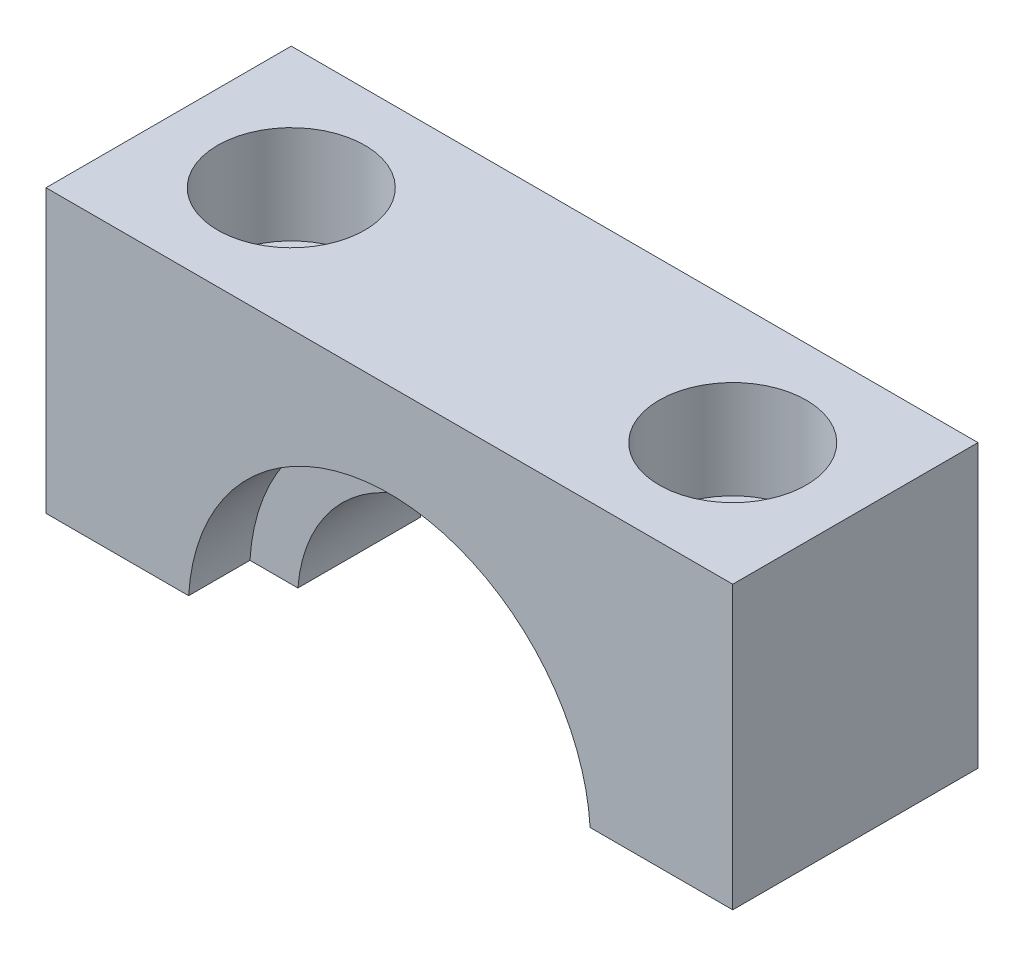
ISO-10303-21;
HEADER;
FILE_DESCRIPTION(('STEP AP214'),'2;1');
FILE_NAME('part.step','',(''),(''),'','','');
FILE_SCHEMA(('AUTOMOTIVE_DESIGN { 1 0 10303 214 1 1 1 1 }'));
ENDSEC;
DATA;
#1=APPLICATION_CONTEXT('core data for automotive mechanical design processes');
#2=APPLICATION_PROTOCOL_DEFINITION('international standard','automotive_design',2000,#1);
#3=PRODUCT_CONTEXT('',#1,'mechanical');
#4=PRODUCT('Part','Part','',(#3));
#5=PRODUCT_RELATED_PRODUCT_CATEGORY('part','',(#4));
#6=PRODUCT_DEFINITION_FORMATION('','',#4);
#7=PRODUCT_DEFINITION_CONTEXT('part definition',#1,'design');
#8=PRODUCT_DEFINITION('design','',#6,#7);
#9=PRODUCT_DEFINITION_SHAPE('','',#8);
#10=(LENGTH_UNIT() NAMED_UNIT(*) SI_UNIT(.MILLI.,.METRE.));
#11=(NAMED_UNIT(*) PLANE_ANGLE_UNIT() SI_UNIT($,.RADIAN.));
#12=(NAMED_UNIT(*) SI_UNIT($,.STERADIAN.) SOLID_ANGLE_UNIT());
#13=UNCERTAINTY_MEASURE_WITH_UNIT(LENGTH_MEASURE(1.E-05),#10,'distance_accuracy_value','');
#14=(GEOMETRIC_REPRESENTATION_CONTEXT(3) GLOBAL_UNCERTAINTY_ASSIGNED_CONTEXT((#13)) GLOBAL_UNIT_ASSIGNED_CONTEXT((#10,
#11,#12)) REPRESENTATION_CONTEXT('',''));
#15=CARTESIAN_POINT('',(0.,0.,0.));
#16=DIRECTION('',(0.,0.,1.));
#17=DIRECTION('',(1.,0.,0.));
#18=AXIS2_PLACEMENT_3D('',#15,#16,#17);
#19=CARTESIAN_POINT('',(9.,15.5,0.));
#20=DIRECTION('',(0.,-1.,0.));
#21=DIRECTION('',(1.,0.,0.));
#22=AXIS2_PLACEMENT_3D('',#19,#20,#21);
#23=CYLINDRICAL_SURFACE('',#22,1.65);
#24=CARTESIAN_POINT('',(9.,0.500000000000005,0.));
#25=DIRECTION('',(0.,-1.,0.));
#26=DIRECTION('',(-1.,0.,0.));
#27=AXIS2_PLACEMENT_3D('',#24,#25,#26);
#28=CIRCLE('',#27,1.65);
#29=CARTESIAN_POINT('',(7.35,0.500000000000004,0.));
#30=VERTEX_POINT('',#29);
#31=EDGE_CURVE('E191',#30,#30,#28,.T.);
#32=ORIENTED_EDGE('',*,*,#31,.T.);
#33=EDGE_LOOP('',(#32));
#34=FACE_BOUND('',#33,.T.);
#35=CARTESIAN_POINT('',(9.,8.,0.));
#36=DIRECTION('',(0.,1.,0.));
#37=DIRECTION('',(-1.,0.,0.));
#38=AXIS2_PLACEMENT_3D('',#35,#36,#37);
#39=CIRCLE('',#38,1.65);
#40=CARTESIAN_POINT('',(7.35,8.,0.));
#41=VERTEX_POINT('',#40);
#42=EDGE_CURVE('E36',#41,#41,#39,.F.);
#43=ORIENTED_EDGE('',*,*,#42,.F.);
#44=EDGE_LOOP('',(#43));
#45=FACE_BOUND('',#44,.T.);
#46=ADVANCED_FACE('F32',(#34,#45),#23,.F.);
#47=CARTESIAN_POINT('',(-9.,15.5,0.));
#48=DIRECTION('',(0.,-1.,0.));
#49=DIRECTION('',(1.,0.,0.));
#50=AXIS2_PLACEMENT_3D('',#47,#48,#49);
#51=CYLINDRICAL_SURFACE('',#50,1.65);
#52=CARTESIAN_POINT('',(-9.,0.500000000000001,0.));
#53=DIRECTION('',(0.,-1.,0.));
#54=DIRECTION('',(1.,0.,0.));
#55=AXIS2_PLACEMENT_3D('',#52,#53,#54);
#56=CIRCLE('',#55,1.65);
#57=CARTESIAN_POINT('',(-7.35,0.500000000000001,0.));
#58=VERTEX_POINT('',#57);
#59=EDGE_CURVE('E139',#58,#58,#56,.T.);
#60=ORIENTED_EDGE('',*,*,#59,.T.);
#61=EDGE_LOOP('',(#60));
#62=FACE_BOUND('',#61,.T.);
#63=CARTESIAN_POINT('',(-9.,8.,0.));
#64=DIRECTION('',(0.,1.,0.));
#65=DIRECTION('',(-1.,0.,0.));
#66=AXIS2_PLACEMENT_3D('',#63,#64,#65);
#67=CIRCLE('',#66,1.65);
#68=CARTESIAN_POINT('',(-10.65,8.,0.));
#69=VERTEX_POINT('',#68);
#70=EDGE_CURVE('E189',#69,#69,#67,.F.);
#71=ORIENTED_EDGE('',*,*,#70,.F.);
#72=EDGE_LOOP('',(#71));
#73=FACE_BOUND('',#72,.T.);
#74=ADVANCED_FACE('F217',(#62,#73),#51,.F.);
#75=CARTESIAN_POINT('',(0.,0.,2.5));
#76=DIRECTION('',(0.,0.,1.));
#77=DIRECTION('',(1.,0.,0.));
#78=AXIS2_PLACEMENT_3D('',#75,#76,#77);
#79=PLANE('',#78);
#80=DIRECTION('',(1.,0.,0.));
#81=VECTOR('',#80,1.);
#82=CARTESIAN_POINT('',(14.,0.5,2.5));
#83=LINE('',#82,#81);
#84=CARTESIAN_POINT('',(6.22996789718856,0.500000000000001,2.5));
#85=VERTEX_POINT('',#84);
#86=CARTESIAN_POINT('',(8.18474190185616,0.500000000000001,2.5));
#87=VERTEX_POINT('',#86);
#88=EDGE_CURVE('E54',#85,#87,#83,.T.);
#89=ORIENTED_EDGE('',*,*,#88,.T.);
#90=CARTESIAN_POINT('',(0.,0.,2.5));
#91=DIRECTION('',(0.,0.,1.));
#92=DIRECTION('',(1.,0.,0.));
#93=AXIS2_PLACEMENT_3D('',#90,#91,#92);
#94=CIRCLE('',#93,8.2);
#95=CARTESIAN_POINT('',(-8.18474190185616,0.500000000000001,2.5));
#96=VERTEX_POINT('',#95);
#97=EDGE_CURVE('E49',#87,#96,#94,.T.);
#98=ORIENTED_EDGE('',*,*,#97,.T.);
#99=DIRECTION('',(1.,0.,0.));
#100=VECTOR('',#99,1.);
#101=CARTESIAN_POINT('',(-6.22996789718856,0.500000000000002,2.5));
#102=LINE('',#101,#100);
#103=CARTESIAN_POINT('',(-6.22996789718856,0.500000000000002,2.5));
#104=VERTEX_POINT('',#103);
#105=EDGE_CURVE('E173',#96,#104,#102,.T.);
#106=ORIENTED_EDGE('',*,*,#105,.T.);
#107=CARTESIAN_POINT('',(0.,0.,2.5));
#108=DIRECTION('',(0.,0.,-1.));
#109=DIRECTION('',(1.,0.,0.));
#110=AXIS2_PLACEMENT_3D('',#107,#108,#109);
#111=CIRCLE('',#110,6.25);
#112=EDGE_CURVE('E169',#104,#85,#111,.T.);
#113=ORIENTED_EDGE('',*,*,#112,.T.);
#114=EDGE_LOOP('',(#89,#98,#106,#113));
#115=FACE_BOUND('',#114,.T.);
#116=ADVANCED_FACE('F223',(#115),#79,.T.);
#117=CARTESIAN_POINT('',(0.,0.,-2.5));
#118=DIRECTION('',(0.,0.,1.));
#119=DIRECTION('',(1.,0.,0.));
#120=AXIS2_PLACEMENT_3D('',#117,#118,#119);
#121=PLANE('',#120);
#122=CARTESIAN_POINT('',(0.,0.,-2.5));
#123=DIRECTION('',(0.,0.,1.));
#124=DIRECTION('',(1.,0.,0.));
#125=AXIS2_PLACEMENT_3D('',#122,#123,#124);
#126=CIRCLE('',#125,8.2);
#127=CARTESIAN_POINT('',(8.18474190185616,0.5,-2.5));
#128=VERTEX_POINT('',#127);
#129=CARTESIAN_POINT('',(-8.18474190185616,0.5,-2.5));
#130=VERTEX_POINT('',#129);
#131=EDGE_CURVE('E11',#128,#130,#126,.T.);
#132=ORIENTED_EDGE('',*,*,#131,.F.);
#133=DIRECTION('',(1.,0.,0.));
#134=VECTOR('',#133,1.);
#135=CARTESIAN_POINT('',(14.,0.5,-2.5));
#136=LINE('',#135,#134);
#137=CARTESIAN_POINT('',(6.22996789718856,0.500000000000001,-2.5));
#138=VERTEX_POINT('',#137);
#139=EDGE_CURVE('E178',#138,#128,#136,.T.);
#140=ORIENTED_EDGE('',*,*,#139,.F.);
#141=CARTESIAN_POINT('',(0.,0.,-2.5));
#142=DIRECTION('',(0.,0.,-1.));
#143=DIRECTION('',(1.,0.,0.));
#144=AXIS2_PLACEMENT_3D('',#141,#142,#143);
#145=CIRCLE('',#144,6.25);
#146=CARTESIAN_POINT('',(-6.22996789718856,0.500000000000002,-2.5));
#147=VERTEX_POINT('',#146);
#148=EDGE_CURVE('E168',#147,#138,#145,.T.);
#149=ORIENTED_EDGE('',*,*,#148,.F.);
#150=DIRECTION('',(1.,0.,0.));
#151=VECTOR('',#150,1.);
#152=CARTESIAN_POINT('',(-6.22996789718856,0.500000000000002,-2.5));
#153=LINE('',#152,#151);
#154=EDGE_CURVE('E171',#130,#147,#153,.T.);
#155=ORIENTED_EDGE('',*,*,#154,.F.);
#156=EDGE_LOOP('',(#132,#140,#149,#155));
#157=FACE_BOUND('',#156,.T.);
#158=ADVANCED_FACE('F245',(#157),#121,.F.);
#159=CARTESIAN_POINT('',(0.,0.,2.5));
#160=DIRECTION('',(0.,0.,-1.));
#161=DIRECTION('',(-1.,0.,0.));
#162=AXIS2_PLACEMENT_3D('',#159,#160,#161);
#163=CYLINDRICAL_SURFACE('',#162,6.25);
#164=ORIENTED_EDGE('',*,*,#148,.T.);
#165=DIRECTION('',(0.,0.,-1.));
#166=VECTOR('',#165,1.);
#167=CARTESIAN_POINT('',(6.22996789718856,0.500000000000001,2.5));
#168=LINE('',#167,#166);
#169=EDGE_CURVE('E41',#85,#138,#168,.T.);
#170=ORIENTED_EDGE('',*,*,#169,.F.);
#171=ORIENTED_EDGE('',*,*,#112,.F.);
#172=DIRECTION('',(0.,0.,-1.));
#173=VECTOR('',#172,1.);
#174=CARTESIAN_POINT('',(-6.22996789718856,0.500000000000002,2.5));
#175=LINE('',#174,#173);
#176=EDGE_CURVE('E175',#104,#147,#175,.T.);
#177=ORIENTED_EDGE('',*,*,#176,.T.);
#178=EDGE_LOOP('',(#164,#170,#171,#177));
#179=FACE_BOUND('',#178,.T.);
#180=ADVANCED_FACE('F34',(#179),#163,.F.);
#181=CARTESIAN_POINT('',(14.,0.5,2.5));
#182=DIRECTION('',(0.,1.,0.));
#183=DIRECTION('',(-1.,0.,0.));
#184=AXIS2_PLACEMENT_3D('',#181,#182,#183);
#185=PLANE('',#184);
#186=ORIENTED_EDGE('',*,*,#31,.F.);
#187=EDGE_LOOP('',(#186));
#188=FACE_BOUND('',#187,.T.);
#189=DIRECTION('',(0.,0.,-1.));
#190=VECTOR('',#189,1.);
#191=CARTESIAN_POINT('',(14.,0.5,2.5));
#192=LINE('',#191,#190);
#193=CARTESIAN_POINT('',(14.,0.5,5.));
#194=VERTEX_POINT('',#193);
#195=CARTESIAN_POINT('',(14.,0.5,-5.));
#196=VERTEX_POINT('',#195);
#197=EDGE_CURVE('E186',#194,#196,#192,.T.);
#198=ORIENTED_EDGE('',*,*,#197,.F.);
#199=DIRECTION('',(1.,0.,0.));
#200=VECTOR('',#199,1.);
#201=CARTESIAN_POINT('',(8.18474190185616,0.5,5.));
#202=LINE('',#201,#200);
#203=CARTESIAN_POINT('',(8.18474190185616,0.5,5.));
#204=VERTEX_POINT('',#203);
#205=EDGE_CURVE('E145',#204,#194,#202,.T.);
#206=ORIENTED_EDGE('',*,*,#205,.F.);
#207=DIRECTION('',(0.,0.,-1.));
#208=VECTOR('',#207,1.);
#209=CARTESIAN_POINT('',(8.18474190185616,0.5,5.));
#210=LINE('',#209,#208);
#211=EDGE_CURVE('E160',#204,#87,#210,.T.);
#212=ORIENTED_EDGE('',*,*,#211,.T.);
#213=ORIENTED_EDGE('',*,*,#88,.F.);
#214=ORIENTED_EDGE('',*,*,#169,.T.);
#215=ORIENTED_EDGE('',*,*,#139,.T.);
#216=CARTESIAN_POINT('',(8.18474190185616,0.5,-5.));
#217=VERTEX_POINT('',#216);
#218=EDGE_CURVE('E148',#128,#217,#210,.T.);
#219=ORIENTED_EDGE('',*,*,#218,.T.);
#220=DIRECTION('',(1.,0.,0.));
#221=VECTOR('',#220,1.);
#222=CARTESIAN_POINT('',(8.18474190185616,0.5,-5.));
#223=LINE('',#222,#221);
#224=EDGE_CURVE('E136',#217,#196,#223,.T.);
#225=ORIENTED_EDGE('',*,*,#224,.T.);
#226=EDGE_LOOP('',(#198,#206,#212,#213,#214,#215,#219,#225));
#227=FACE_BOUND('',#226,.T.);
#228=ADVANCED_FACE('F259',(#188,#227),#185,.F.);
#229=CARTESIAN_POINT('',(14.,12.,2.5));
#230=DIRECTION('',(-1.,0.,0.));
#231=DIRECTION('',(0.,-1.,0.));
#232=AXIS2_PLACEMENT_3D('',#229,#230,#231);
#233=PLANE('',#232);
#234=ORIENTED_EDGE('',*,*,#197,.T.);
#235=DIRECTION('',(0.,1.,0.));
#236=VECTOR('',#235,1.);
#237=CARTESIAN_POINT('',(14.,0.5,-5.));
#238=LINE('',#237,#236);
#239=CARTESIAN_POINT('',(14.,12.,-5.));
#240=VERTEX_POINT('',#239);
#241=EDGE_CURVE('E133',#196,#240,#238,.T.);
#242=ORIENTED_EDGE('',*,*,#241,.T.);
#243=DIRECTION('',(0.,0.,-1.));
#244=VECTOR('',#243,1.);
#245=CARTESIAN_POINT('',(14.,12.,2.5));
#246=LINE('',#245,#244);
#247=CARTESIAN_POINT('',(14.,12.,5.));
#248=VERTEX_POINT('',#247);
#249=EDGE_CURVE('E118',#248,#240,#246,.T.);
#250=ORIENTED_EDGE('',*,*,#249,.F.);
#251=DIRECTION('',(0.,1.,0.));
#252=VECTOR('',#251,1.);
#253=CARTESIAN_POINT('',(14.,0.5,5.));
#254=LINE('',#253,#252);
#255=EDGE_CURVE('E132',#194,#248,#254,.T.);
#256=ORIENTED_EDGE('',*,*,#255,.F.);
#257=EDGE_LOOP('',(#234,#242,#250,#256));
#258=FACE_BOUND('',#257,.T.);
#259=ADVANCED_FACE('F256',(#258),#233,.F.);
#260=CARTESIAN_POINT('',(-14.,12.,2.5));
#261=DIRECTION('',(0.,-1.,0.));
#262=DIRECTION('',(1.,0.,0.));
#263=AXIS2_PLACEMENT_3D('',#260,#261,#262);
#264=PLANE('',#263);
#265=CARTESIAN_POINT('',(9.,12.,0.));
#266=DIRECTION('',(0.,1.,0.));
#267=DIRECTION('',(-1.,0.,0.));
#268=AXIS2_PLACEMENT_3D('',#265,#266,#267);
#269=CIRCLE('',#268,3.);
#270=CARTESIAN_POINT('',(5.99999999999999,12.,0.));
#271=VERTEX_POINT('',#270);
#272=EDGE_CURVE('E204',#271,#271,#269,.T.);
#273=ORIENTED_EDGE('',*,*,#272,.F.);
#274=EDGE_LOOP('',(#273));
#275=FACE_BOUND('',#274,.T.);
#276=CARTESIAN_POINT('',(-9.,12.,0.));
#277=DIRECTION('',(0.,1.,0.));
#278=DIRECTION('',(-1.,0.,0.));
#279=AXIS2_PLACEMENT_3D('',#276,#277,#278);
#280=CIRCLE('',#279,3.);
#281=CARTESIAN_POINT('',(-12.,12.,0.));
#282=VERTEX_POINT('',#281);
#283=EDGE_CURVE('E197',#282,#282,#280,.T.);
#284=ORIENTED_EDGE('',*,*,#283,.F.);
#285=EDGE_LOOP('',(#284));
#286=FACE_BOUND('',#285,.T.);
#287=ORIENTED_EDGE('',*,*,#249,.T.);
#288=DIRECTION('',(-1.,0.,0.));
#289=VECTOR('',#288,1.);
#290=CARTESIAN_POINT('',(14.,12.,-5.));
#291=LINE('',#290,#289);
#292=CARTESIAN_POINT('',(-14.,12.,-5.));
#293=VERTEX_POINT('',#292);
#294=EDGE_CURVE('E114',#240,#293,#291,.T.);
#295=ORIENTED_EDGE('',*,*,#294,.T.);
#296=DIRECTION('',(0.,0.,-1.));
#297=VECTOR('',#296,1.);
#298=CARTESIAN_POINT('',(-14.,12.,2.5));
#299=LINE('',#298,#297);
#300=CARTESIAN_POINT('',(-14.,12.,5.));
#301=VERTEX_POINT('',#300);
#302=EDGE_CURVE('E108',#301,#293,#299,.T.);
#303=ORIENTED_EDGE('',*,*,#302,.F.);
#304=DIRECTION('',(-1.,0.,0.));
#305=VECTOR('',#304,1.);
#306=CARTESIAN_POINT('',(14.,12.,5.));
#307=LINE('',#306,#305);
#308=EDGE_CURVE('E112',#248,#301,#307,.T.);
#309=ORIENTED_EDGE('',*,*,#308,.F.);
#310=EDGE_LOOP('',(#287,#295,#303,#309));
#311=FACE_BOUND('',#310,.T.);
#312=ADVANCED_FACE('F110',(#275,#286,#311),#264,.F.);
#313=CARTESIAN_POINT('',(-14.,0.5,2.5));
#314=DIRECTION('',(1.,0.,0.));
#315=DIRECTION('',(0.,0.,-1.));
#316=AXIS2_PLACEMENT_3D('',#313,#314,#315);
#317=PLANE('',#316);
#318=ORIENTED_EDGE('',*,*,#302,.T.);
#319=DIRECTION('',(0.,-1.,0.));
#320=VECTOR('',#319,1.);
#321=CARTESIAN_POINT('',(-14.,12.,-5.));
#322=LINE('',#321,#320);
#323=CARTESIAN_POINT('',(-14.,0.5,-5.));
#324=VERTEX_POINT('',#323);
#325=EDGE_CURVE('E150',#293,#324,#322,.T.);
#326=ORIENTED_EDGE('',*,*,#325,.T.);
#327=DIRECTION('',(0.,0.,-1.));
#328=VECTOR('',#327,1.);
#329=CARTESIAN_POINT('',(-14.,0.5,2.5));
#330=LINE('',#329,#328);
#331=CARTESIAN_POINT('',(-14.,0.5,5.));
#332=VERTEX_POINT('',#331);
#333=EDGE_CURVE('E119',#332,#324,#330,.T.);
#334=ORIENTED_EDGE('',*,*,#333,.F.);
#335=DIRECTION('',(0.,-1.,0.));
#336=VECTOR('',#335,1.);
#337=CARTESIAN_POINT('',(-14.,12.,5.));
#338=LINE('',#337,#336);
#339=EDGE_CURVE('E122',#301,#332,#338,.T.);
#340=ORIENTED_EDGE('',*,*,#339,.F.);
#341=EDGE_LOOP('',(#318,#326,#334,#340));
#342=FACE_BOUND('',#341,.T.);
#343=ADVANCED_FACE('F123',(#342),#317,.F.);
#344=CARTESIAN_POINT('',(-6.22996789718856,0.500000000000002,2.5));
#345=DIRECTION('',(0.,1.,0.));
#346=DIRECTION('',(-1.,0.,0.));
#347=AXIS2_PLACEMENT_3D('',#344,#345,#346);
#348=PLANE('',#347);
#349=ORIENTED_EDGE('',*,*,#59,.F.);
#350=EDGE_LOOP('',(#349));
#351=FACE_BOUND('',#350,.T.);
#352=ORIENTED_EDGE('',*,*,#333,.T.);
#353=DIRECTION('',(1.,0.,0.));
#354=VECTOR('',#353,1.);
#355=CARTESIAN_POINT('',(-14.,0.5,-5.));
#356=LINE('',#355,#354);
#357=CARTESIAN_POINT('',(-8.18474190185616,0.5,-5.));
#358=VERTEX_POINT('',#357);
#359=EDGE_CURVE('E152',#324,#358,#356,.T.);
#360=ORIENTED_EDGE('',*,*,#359,.T.);
#361=DIRECTION('',(0.,0.,-1.));
#362=VECTOR('',#361,1.);
#363=CARTESIAN_POINT('',(-8.18474190185616,0.5,5.));
#364=LINE('',#363,#362);
#365=EDGE_CURVE('E163',#130,#358,#364,.T.);
#366=ORIENTED_EDGE('',*,*,#365,.F.);
#367=ORIENTED_EDGE('',*,*,#154,.T.);
#368=ORIENTED_EDGE('',*,*,#176,.F.);
#369=ORIENTED_EDGE('',*,*,#105,.F.);
#370=CARTESIAN_POINT('',(-8.18474190185616,0.5,5.));
#371=VERTEX_POINT('',#370);
#372=EDGE_CURVE('E164',#371,#96,#364,.T.);
#373=ORIENTED_EDGE('',*,*,#372,.F.);
#374=DIRECTION('',(1.,0.,0.));
#375=VECTOR('',#374,1.);
#376=CARTESIAN_POINT('',(-14.,0.5,5.));
#377=LINE('',#376,#375);
#378=EDGE_CURVE('E126',#332,#371,#377,.T.);
#379=ORIENTED_EDGE('',*,*,#378,.F.);
#380=EDGE_LOOP('',(#352,#360,#366,#367,#368,#369,#373,#379));
#381=FACE_BOUND('',#380,.T.);
#382=ADVANCED_FACE('F238',(#351,#381),#348,.F.);
#383=CARTESIAN_POINT('',(0.,0.,-5.));
#384=DIRECTION('',(0.,0.,1.));
#385=DIRECTION('',(1.,0.,0.));
#386=AXIS2_PLACEMENT_3D('',#383,#384,#385);
#387=PLANE('',#386);
#388=ORIENTED_EDGE('',*,*,#294,.F.);
#389=ORIENTED_EDGE('',*,*,#241,.F.);
#390=ORIENTED_EDGE('',*,*,#224,.F.);
#391=CARTESIAN_POINT('',(0.,0.,-5.));
#392=DIRECTION('',(0.,0.,-1.));
#393=DIRECTION('',(1.,0.,0.));
#394=AXIS2_PLACEMENT_3D('',#391,#392,#393);
#395=CIRCLE('',#394,8.2);
#396=EDGE_CURVE('E155',#358,#217,#395,.T.);
#397=ORIENTED_EDGE('',*,*,#396,.F.);
#398=ORIENTED_EDGE('',*,*,#359,.F.);
#399=ORIENTED_EDGE('',*,*,#325,.F.);
#400=EDGE_LOOP('',(#388,#389,#390,#397,#398,#399));
#401=FACE_BOUND('',#400,.T.);
#402=ADVANCED_FACE('F234',(#401),#387,.F.);
#403=CARTESIAN_POINT('',(0.,0.,5.));
#404=DIRECTION('',(0.,0.,-1.));
#405=DIRECTION('',(-1.,0.,0.));
#406=AXIS2_PLACEMENT_3D('',#403,#404,#405);
#407=CYLINDRICAL_SURFACE('',#406,8.2);
#408=ORIENTED_EDGE('',*,*,#218,.F.);
#409=ORIENTED_EDGE('',*,*,#131,.T.);
#410=ORIENTED_EDGE('',*,*,#365,.T.);
#411=ORIENTED_EDGE('',*,*,#396,.T.);
#412=EDGE_LOOP('',(#408,#409,#410,#411));
#413=FACE_BOUND('',#412,.T.);
#414=ADVANCED_FACE('F237',(#413),#407,.F.);
#415=ORIENTED_EDGE('',*,*,#97,.F.);
#416=ORIENTED_EDGE('',*,*,#211,.F.);
#417=CARTESIAN_POINT('',(0.,0.,5.));
#418=DIRECTION('',(0.,0.,-1.));
#419=DIRECTION('',(1.,0.,0.));
#420=AXIS2_PLACEMENT_3D('',#417,#418,#419);
#421=CIRCLE('',#420,8.2);
#422=EDGE_CURVE('E143',#371,#204,#421,.T.);
#423=ORIENTED_EDGE('',*,*,#422,.F.);
#424=ORIENTED_EDGE('',*,*,#372,.T.);
#425=EDGE_LOOP('',(#415,#416,#423,#424));
#426=FACE_BOUND('',#425,.T.);
#427=ADVANCED_FACE('F233',(#426),#407,.F.);
#428=CARTESIAN_POINT('',(0.,0.,5.));
#429=DIRECTION('',(0.,0.,1.));
#430=DIRECTION('',(1.,0.,0.));
#431=AXIS2_PLACEMENT_3D('',#428,#429,#430);
#432=PLANE('',#431);
#433=ORIENTED_EDGE('',*,*,#308,.T.);
#434=ORIENTED_EDGE('',*,*,#339,.T.);
#435=ORIENTED_EDGE('',*,*,#378,.T.);
#436=ORIENTED_EDGE('',*,*,#422,.T.);
#437=ORIENTED_EDGE('',*,*,#205,.T.);
#438=ORIENTED_EDGE('',*,*,#255,.T.);
#439=EDGE_LOOP('',(#433,#434,#435,#436,#437,#438));
#440=FACE_BOUND('',#439,.T.);
#441=ADVANCED_FACE('F129',(#440),#432,.T.);
#442=CARTESIAN_POINT('',(-9.,8.,0.));
#443=DIRECTION('',(0.,1.,0.));
#444=DIRECTION('',(-1.,0.,0.));
#445=AXIS2_PLACEMENT_3D('',#442,#443,#444);
#446=PLANE('',#445);
#447=CARTESIAN_POINT('',(-9.,8.,0.));
#448=DIRECTION('',(0.,1.,0.));
#449=DIRECTION('',(-1.,0.,0.));
#450=AXIS2_PLACEMENT_3D('',#447,#448,#449);
#451=CIRCLE('',#450,3.);
#452=CARTESIAN_POINT('',(-12.,8.,0.));
#453=VERTEX_POINT('',#452);
#454=EDGE_CURVE('E192',#453,#453,#451,.T.);
#455=ORIENTED_EDGE('',*,*,#454,.T.);
#456=EDGE_LOOP('',(#455));
#457=FACE_BOUND('',#456,.T.);
#458=ORIENTED_EDGE('',*,*,#70,.T.);
#459=EDGE_LOOP('',(#458));
#460=FACE_BOUND('',#459,.T.);
#461=ADVANCED_FACE('F232',(#457,#460),#446,.T.);
#462=CARTESIAN_POINT('',(-9.,8.,0.));
#463=DIRECTION('',(0.,1.,0.));
#464=DIRECTION('',(-1.,0.,0.));
#465=AXIS2_PLACEMENT_3D('',#462,#463,#464);
#466=CYLINDRICAL_SURFACE('',#465,3.);
#467=ORIENTED_EDGE('',*,*,#454,.F.);
#468=EDGE_LOOP('',(#467));
#469=FACE_BOUND('',#468,.T.);
#470=ORIENTED_EDGE('',*,*,#283,.T.);
#471=EDGE_LOOP('',(#470));
#472=FACE_BOUND('',#471,.T.);
#473=ADVANCED_FACE('F227',(#469,#472),#466,.F.);
#474=CARTESIAN_POINT('',(9.,8.,0.));
#475=DIRECTION('',(0.,1.,0.));
#476=DIRECTION('',(-1.,0.,0.));
#477=AXIS2_PLACEMENT_3D('',#474,#475,#476);
#478=PLANE('',#477);
#479=CARTESIAN_POINT('',(9.,8.,0.));
#480=DIRECTION('',(0.,1.,0.));
#481=DIRECTION('',(-1.,0.,0.));
#482=AXIS2_PLACEMENT_3D('',#479,#480,#481);
#483=CIRCLE('',#482,3.);
#484=CARTESIAN_POINT('',(5.99999999999999,8.,0.));
#485=VERTEX_POINT('',#484);
#486=EDGE_CURVE('E207',#485,#485,#483,.T.);
#487=ORIENTED_EDGE('',*,*,#486,.T.);
#488=EDGE_LOOP('',(#487));
#489=FACE_BOUND('',#488,.T.);
#490=ORIENTED_EDGE('',*,*,#42,.T.);
#491=EDGE_LOOP('',(#490));
#492=FACE_BOUND('',#491,.T.);
#493=ADVANCED_FACE('F214',(#489,#492),#478,.T.);
#494=CARTESIAN_POINT('',(9.,8.,0.));
#495=DIRECTION('',(0.,1.,0.));
#496=DIRECTION('',(-1.,0.,0.));
#497=AXIS2_PLACEMENT_3D('',#494,#495,#496);
#498=CYLINDRICAL_SURFACE('',#497,3.);
#499=ORIENTED_EDGE('',*,*,#486,.F.);
#500=EDGE_LOOP('',(#499));
#501=FACE_BOUND('',#500,.T.);
#502=ORIENTED_EDGE('',*,*,#272,.T.);
#503=EDGE_LOOP('',(#502));
#504=FACE_BOUND('',#503,.T.);
#505=ADVANCED_FACE('F317',(#501,#504),#498,.F.);
#506=CLOSED_SHELL('',(#46,#74,#116,#158,#180,#228,#259,#312,#343,#382,#402,#414,#427,#441,#461,
#473,#493,#505));
#507=MANIFOLD_SOLID_BREP('B2',#506);
#508=ADVANCED_BREP_SHAPE_REPRESENTATION('',(#18,#507),#14);
#509=SHAPE_DEFINITION_REPRESENTATION(#9,#508);
ENDSEC;
END-ISO-10303-21;
